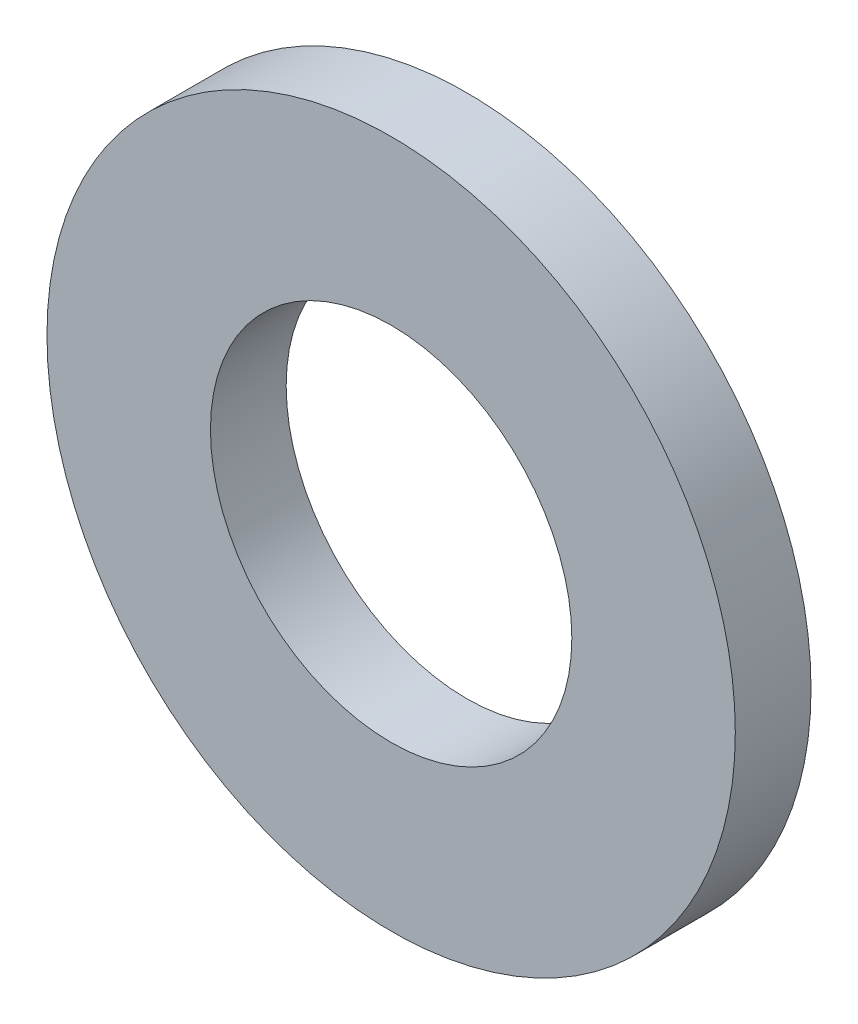
ISO-10303-21;
HEADER;
FILE_DESCRIPTION(('STEP AP214'),'2;1');
FILE_NAME('part.step','',(''),(''),'','','');
FILE_SCHEMA(('AUTOMOTIVE_DESIGN { 1 0 10303 214 1 1 1 1 }'));
ENDSEC;
DATA;
#1=APPLICATION_CONTEXT('core data for automotive mechanical design processes');
#2=APPLICATION_PROTOCOL_DEFINITION('international standard','automotive_design',2000,#1);
#3=PRODUCT_CONTEXT('',#1,'mechanical');
#4=PRODUCT('Part','Part','',(#3));
#5=PRODUCT_RELATED_PRODUCT_CATEGORY('part','',(#4));
#6=PRODUCT_DEFINITION_FORMATION('','',#4);
#7=PRODUCT_DEFINITION_CONTEXT('part definition',#1,'design');
#8=PRODUCT_DEFINITION('design','',#6,#7);
#9=PRODUCT_DEFINITION_SHAPE('','',#8);
#10=(LENGTH_UNIT() NAMED_UNIT(*) SI_UNIT(.MILLI.,.METRE.));
#11=(NAMED_UNIT(*) PLANE_ANGLE_UNIT() SI_UNIT($,.RADIAN.));
#12=(NAMED_UNIT(*) SI_UNIT($,.STERADIAN.) SOLID_ANGLE_UNIT());
#13=UNCERTAINTY_MEASURE_WITH_UNIT(LENGTH_MEASURE(1.E-05),#10,'distance_accuracy_value','');
#14=(GEOMETRIC_REPRESENTATION_CONTEXT(3) GLOBAL_UNCERTAINTY_ASSIGNED_CONTEXT((#13)) GLOBAL_UNIT_ASSIGNED_CONTEXT((#10,
#11,#12)) REPRESENTATION_CONTEXT('',''));
#15=CARTESIAN_POINT('',(0.,0.,0.));
#16=DIRECTION('',(0.,0.,1.));
#17=DIRECTION('',(1.,0.,0.));
#18=AXIS2_PLACEMENT_3D('',#15,#16,#17);
#19=CARTESIAN_POINT('',(0.,0.,0.));
#20=DIRECTION('',(0.,0.,1.));
#21=DIRECTION('',(1.,0.,0.));
#22=AXIS2_PLACEMENT_3D('',#19,#20,#21);
#23=PLANE('',#22);
#24=CARTESIAN_POINT('',(0.,0.,0.));
#25=DIRECTION('',(0.,0.,-1.));
#26=DIRECTION('',(-1.,0.,0.));
#27=AXIS2_PLACEMENT_3D('',#24,#25,#26);
#28=CIRCLE('',#27,5.25000000000001);
#29=CARTESIAN_POINT('',(-5.25000000000001,0.,0.));
#30=VERTEX_POINT('',#29);
#31=EDGE_CURVE('E27',#30,#30,#28,.F.);
#32=ORIENTED_EDGE('',*,*,#31,.T.);
#33=EDGE_LOOP('',(#32));
#34=FACE_BOUND('',#33,.T.);
#35=CARTESIAN_POINT('',(0.,0.,0.));
#36=DIRECTION('',(0.,0.,-1.));
#37=DIRECTION('',(-1.,0.,0.));
#38=AXIS2_PLACEMENT_3D('',#35,#36,#37);
#39=CIRCLE('',#38,10.);
#40=CARTESIAN_POINT('',(-10.,0.,0.));
#41=VERTEX_POINT('',#40);
#42=EDGE_CURVE('E18',#41,#41,#39,.F.);
#43=ORIENTED_EDGE('',*,*,#42,.F.);
#44=EDGE_LOOP('',(#43));
#45=FACE_BOUND('',#44,.T.);
#46=ADVANCED_FACE('F15',(#34,#45),#23,.F.);
#47=CARTESIAN_POINT('',(0.,0.,2.2));
#48=DIRECTION('',(0.,0.,-1.));
#49=DIRECTION('',(-1.,0.,0.));
#50=AXIS2_PLACEMENT_3D('',#47,#48,#49);
#51=CYLINDRICAL_SURFACE('',#50,10.);
#52=CARTESIAN_POINT('',(0.,0.,2.2));
#53=DIRECTION('',(0.,0.,-1.));
#54=DIRECTION('',(-1.,0.,0.));
#55=AXIS2_PLACEMENT_3D('',#52,#53,#54);
#56=CIRCLE('',#55,10.);
#57=CARTESIAN_POINT('',(-10.,0.,2.2));
#58=VERTEX_POINT('',#57);
#59=EDGE_CURVE('E22',#58,#58,#56,.F.);
#60=ORIENTED_EDGE('',*,*,#59,.F.);
#61=EDGE_LOOP('',(#60));
#62=FACE_BOUND('',#61,.T.);
#63=ORIENTED_EDGE('',*,*,#42,.T.);
#64=EDGE_LOOP('',(#63));
#65=FACE_BOUND('',#64,.T.);
#66=ADVANCED_FACE('F35',(#62,#65),#51,.T.);
#67=CARTESIAN_POINT('',(0.,0.,2.2));
#68=DIRECTION('',(0.,0.,-1.));
#69=DIRECTION('',(-1.,0.,0.));
#70=AXIS2_PLACEMENT_3D('',#67,#68,#69);
#71=CYLINDRICAL_SURFACE('',#70,5.25000000000001);
#72=ORIENTED_EDGE('',*,*,#31,.F.);
#73=EDGE_LOOP('',(#72));
#74=FACE_BOUND('',#73,.T.);
#75=CARTESIAN_POINT('',(0.,0.,2.2));
#76=DIRECTION('',(0.,0.,-1.));
#77=DIRECTION('',(-1.,0.,0.));
#78=AXIS2_PLACEMENT_3D('',#75,#76,#77);
#79=CIRCLE('',#78,5.25000000000001);
#80=CARTESIAN_POINT('',(-5.25000000000001,0.,2.2));
#81=VERTEX_POINT('',#80);
#82=EDGE_CURVE('E10',#81,#81,#79,.T.);
#83=ORIENTED_EDGE('',*,*,#82,.F.);
#84=EDGE_LOOP('',(#83));
#85=FACE_BOUND('',#84,.T.);
#86=ADVANCED_FACE('F42',(#74,#85),#71,.F.);
#87=CARTESIAN_POINT('',(0.,0.,2.2));
#88=DIRECTION('',(0.,0.,1.));
#89=DIRECTION('',(1.,0.,0.));
#90=AXIS2_PLACEMENT_3D('',#87,#88,#89);
#91=PLANE('',#90);
#92=ORIENTED_EDGE('',*,*,#82,.T.);
#93=EDGE_LOOP('',(#92));
#94=FACE_BOUND('',#93,.T.);
#95=ORIENTED_EDGE('',*,*,#59,.T.);
#96=EDGE_LOOP('',(#95));
#97=FACE_BOUND('',#96,.T.);
#98=ADVANCED_FACE('F44',(#94,#97),#91,.T.);
#99=CLOSED_SHELL('',(#46,#66,#86,#98));
#100=MANIFOLD_SOLID_BREP('B1',#99);
#101=ADVANCED_BREP_SHAPE_REPRESENTATION('',(#18,#100),#14);
#102=SHAPE_DEFINITION_REPRESENTATION(#9,#101);
ENDSEC;
END-ISO-10303-21;
